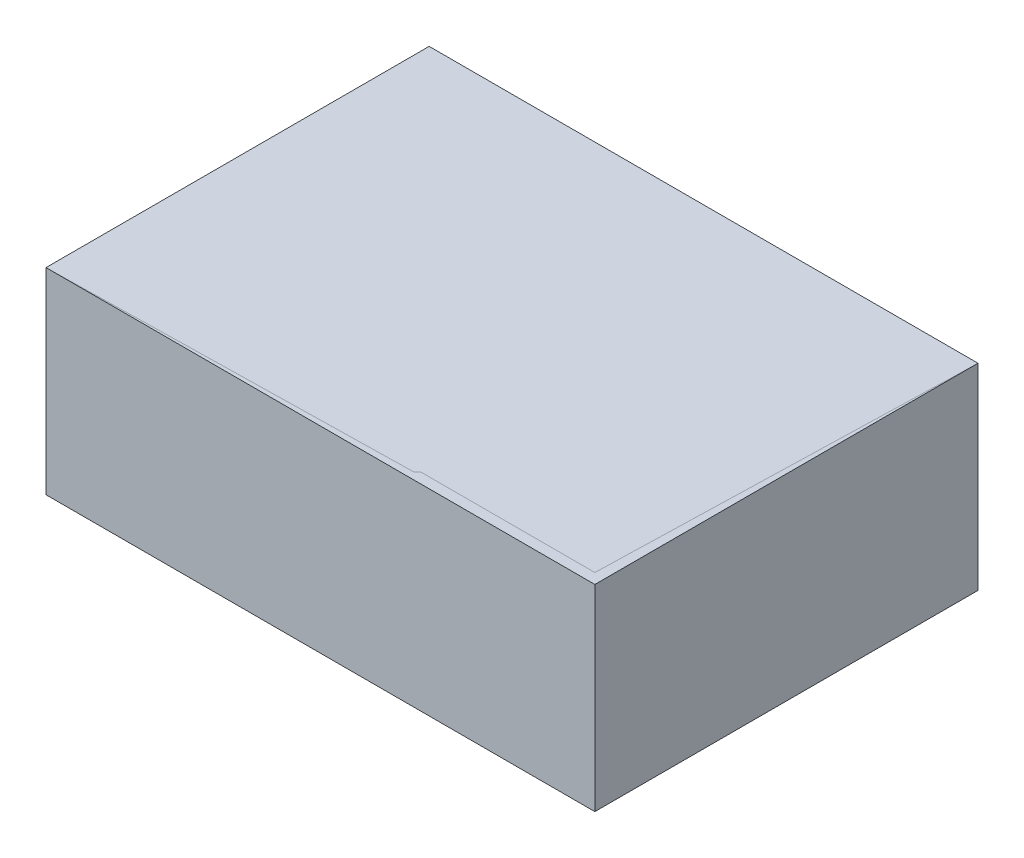
ISO-10303-21;
HEADER;
FILE_DESCRIPTION(('STEP AP214'),'2;1');
FILE_NAME('part.step','',(''),(''),'','','');
FILE_SCHEMA(('AUTOMOTIVE_DESIGN { 1 0 10303 214 1 1 1 1 }'));
ENDSEC;
DATA;
#1=APPLICATION_CONTEXT('core data for automotive mechanical design processes');
#2=APPLICATION_PROTOCOL_DEFINITION('international standard','automotive_design',2000,#1);
#3=PRODUCT_CONTEXT('',#1,'mechanical');
#4=PRODUCT('Part','Part','',(#3));
#5=PRODUCT_RELATED_PRODUCT_CATEGORY('part','',(#4));
#6=PRODUCT_DEFINITION_FORMATION('','',#4);
#7=PRODUCT_DEFINITION_CONTEXT('part definition',#1,'design');
#8=PRODUCT_DEFINITION('design','',#6,#7);
#9=PRODUCT_DEFINITION_SHAPE('','',#8);
#10=(LENGTH_UNIT() NAMED_UNIT(*) SI_UNIT(.MILLI.,.METRE.));
#11=(NAMED_UNIT(*) PLANE_ANGLE_UNIT() SI_UNIT($,.RADIAN.));
#12=(NAMED_UNIT(*) SI_UNIT($,.STERADIAN.) SOLID_ANGLE_UNIT());
#13=UNCERTAINTY_MEASURE_WITH_UNIT(LENGTH_MEASURE(1.E-05),#10,'distance_accuracy_value','');
#14=(GEOMETRIC_REPRESENTATION_CONTEXT(3) GLOBAL_UNCERTAINTY_ASSIGNED_CONTEXT((#13)) GLOBAL_UNIT_ASSIGNED_CONTEXT((#10,
#11,#12)) REPRESENTATION_CONTEXT('',''));
#15=CARTESIAN_POINT('',(0.,0.,0.));
#16=DIRECTION('',(0.,0.,1.));
#17=DIRECTION('',(1.,0.,0.));
#18=AXIS2_PLACEMENT_3D('',#15,#16,#17);
#19=CARTESIAN_POINT('',(0.,95.,0.));
#20=DIRECTION('',(0.,1.,0.));
#21=DIRECTION('',(0.,0.,1.));
#22=AXIS2_PLACEMENT_3D('',#19,#20,#21);
#23=PLANE('',#22);
#24=DIRECTION('',(1.,0.,0.));
#25=VECTOR('',#24,1.);
#26=CARTESIAN_POINT('',(-132.5,95.,92.5));
#27=LINE('',#26,#25);
#28=CARTESIAN_POINT('',(-132.5,95.,92.5));
#29=VERTEX_POINT('',#28);
#30=CARTESIAN_POINT('',(132.5,95.,92.5));
#31=VERTEX_POINT('',#30);
#32=EDGE_CURVE('E56',#29,#31,#27,.T.);
#33=ORIENTED_EDGE('',*,*,#32,.T.);
#34=DIRECTION('',(0.,0.,-1.));
#35=VECTOR('',#34,1.);
#36=CARTESIAN_POINT('',(132.5,95.,92.5));
#37=LINE('',#36,#35);
#38=CARTESIAN_POINT('',(132.5,95.,-92.5));
#39=VERTEX_POINT('',#38);
#40=EDGE_CURVE('E67',#31,#39,#37,.T.);
#41=ORIENTED_EDGE('',*,*,#40,.T.);
#42=DIRECTION('',(-1.,0.,0.));
#43=VECTOR('',#42,1.);
#44=CARTESIAN_POINT('',(132.5,95.,-92.5));
#45=LINE('',#44,#43);
#46=CARTESIAN_POINT('',(-132.5,95.,-92.5));
#47=VERTEX_POINT('',#46);
#48=EDGE_CURVE('E52',#39,#47,#45,.T.);
#49=ORIENTED_EDGE('',*,*,#48,.T.);
#50=DIRECTION('',(0.,0.,1.));
#51=VECTOR('',#50,1.);
#52=CARTESIAN_POINT('',(-132.5,95.,-92.5));
#53=LINE('',#52,#51);
#54=EDGE_CURVE('E12',#47,#29,#53,.T.);
#55=ORIENTED_EDGE('',*,*,#54,.T.);
#56=EDGE_LOOP('',(#33,#41,#49,#55));
#57=FACE_BOUND('',#56,.T.);
#58=ADVANCED_FACE('F47',(#57),#23,.T.);
#59=OPEN_SHELL('',(#58));
#60=SHELL_BASED_SURFACE_MODEL('B2',(#59));
#61=CARTESIAN_POINT('',(132.5,95.,92.5));
#62=DIRECTION('',(-1.,0.,0.));
#63=DIRECTION('',(0.,0.,1.));
#64=AXIS2_PLACEMENT_3D('',#61,#62,#63);
#65=PLANE('',#64);
#66=DIRECTION('',(0.,0.,-1.));
#67=VECTOR('',#66,1.);
#68=CARTESIAN_POINT('',(132.5,0.,92.5));
#69=LINE('',#68,#67);
#70=CARTESIAN_POINT('',(132.5,0.,92.5));
#71=VERTEX_POINT('',#70);
#72=CARTESIAN_POINT('',(132.5,0.,-92.5));
#73=VERTEX_POINT('',#72);
#74=EDGE_CURVE('E199',#71,#73,#69,.T.);
#75=ORIENTED_EDGE('',*,*,#74,.T.);
#76=DIRECTION('',(0.,-1.,0.));
#77=VECTOR('',#76,1.);
#78=CARTESIAN_POINT('',(132.5,95.,-92.5));
#79=LINE('',#78,#77);
#80=CARTESIAN_POINT('',(132.5,95.,-92.5));
#81=VERTEX_POINT('',#80);
#82=EDGE_CURVE('E45',#81,#73,#79,.T.);
#83=ORIENTED_EDGE('',*,*,#82,.F.);
#84=DIRECTION('',(0.,0.,-1.));
#85=VECTOR('',#84,1.);
#86=CARTESIAN_POINT('',(132.5,95.,92.5));
#87=LINE('',#86,#85);
#88=CARTESIAN_POINT('',(132.5,95.,92.5));
#89=VERTEX_POINT('',#88);
#90=EDGE_CURVE('E203',#89,#81,#87,.T.);
#91=ORIENTED_EDGE('',*,*,#90,.F.);
#92=DIRECTION('',(0.,-1.,0.));
#93=VECTOR('',#92,1.);
#94=CARTESIAN_POINT('',(132.5,95.,92.5));
#95=LINE('',#94,#93);
#96=EDGE_CURVE('E209',#89,#71,#95,.T.);
#97=ORIENTED_EDGE('',*,*,#96,.T.);
#98=EDGE_LOOP('',(#75,#83,#91,#97));
#99=FACE_BOUND('',#98,.T.);
#100=ADVANCED_FACE('F91',(#99),#65,.F.);
#101=CARTESIAN_POINT('',(-132.5,95.,-92.5));
#102=DIRECTION('',(0.,0.,1.));
#103=DIRECTION('',(1.,0.,0.));
#104=AXIS2_PLACEMENT_3D('',#101,#102,#103);
#105=PLANE('',#104);
#106=DIRECTION('',(-1.,0.,0.));
#107=VECTOR('',#106,1.);
#108=CARTESIAN_POINT('',(-132.5,0.,-92.5));
#109=LINE('',#108,#107);
#110=CARTESIAN_POINT('',(-132.5,0.,-92.5));
#111=VERTEX_POINT('',#110);
#112=EDGE_CURVE('E212',#73,#111,#109,.T.);
#113=ORIENTED_EDGE('',*,*,#112,.T.);
#114=DIRECTION('',(0.,-1.,0.));
#115=VECTOR('',#114,1.);
#116=CARTESIAN_POINT('',(-132.5,95.,-92.5));
#117=LINE('',#116,#115);
#118=CARTESIAN_POINT('',(-132.5,95.,-92.5));
#119=VERTEX_POINT('',#118);
#120=EDGE_CURVE('E98',#119,#111,#117,.T.);
#121=ORIENTED_EDGE('',*,*,#120,.F.);
#122=DIRECTION('',(-1.,0.,0.));
#123=VECTOR('',#122,1.);
#124=CARTESIAN_POINT('',(-132.5,95.,-92.5));
#125=LINE('',#124,#123);
#126=EDGE_CURVE('E142',#81,#119,#125,.T.);
#127=ORIENTED_EDGE('',*,*,#126,.F.);
#128=ORIENTED_EDGE('',*,*,#82,.T.);
#129=EDGE_LOOP('',(#113,#121,#127,#128));
#130=FACE_BOUND('',#129,.T.);
#131=ADVANCED_FACE('F241',(#130),#105,.F.);
#132=CARTESIAN_POINT('',(-132.5,95.,92.5));
#133=DIRECTION('',(1.,0.,0.));
#134=DIRECTION('',(0.,0.,-1.));
#135=AXIS2_PLACEMENT_3D('',#132,#133,#134);
#136=PLANE('',#135);
#137=DIRECTION('',(0.,0.,1.));
#138=VECTOR('',#137,1.);
#139=CARTESIAN_POINT('',(-132.5,0.,92.5));
#140=LINE('',#139,#138);
#141=CARTESIAN_POINT('',(-132.5,0.,92.5));
#142=VERTEX_POINT('',#141);
#143=EDGE_CURVE('E214',#111,#142,#140,.T.);
#144=ORIENTED_EDGE('',*,*,#143,.T.);
#145=DIRECTION('',(0.,-1.,0.));
#146=VECTOR('',#145,1.);
#147=CARTESIAN_POINT('',(-132.5,95.,92.5));
#148=LINE('',#147,#146);
#149=CARTESIAN_POINT('',(-132.5,95.,92.5));
#150=VERTEX_POINT('',#149);
#151=EDGE_CURVE('E218',#150,#142,#148,.T.);
#152=ORIENTED_EDGE('',*,*,#151,.F.);
#153=DIRECTION('',(0.,0.,1.));
#154=VECTOR('',#153,1.);
#155=CARTESIAN_POINT('',(-132.5,95.,92.5));
#156=LINE('',#155,#154);
#157=EDGE_CURVE('E206',#119,#150,#156,.T.);
#158=ORIENTED_EDGE('',*,*,#157,.F.);
#159=ORIENTED_EDGE('',*,*,#120,.T.);
#160=EDGE_LOOP('',(#144,#152,#158,#159));
#161=FACE_BOUND('',#160,.T.);
#162=ADVANCED_FACE('F223',(#161),#136,.F.);
#163=CARTESIAN_POINT('',(-132.5,95.,92.5));
#164=DIRECTION('',(0.,0.,-1.));
#165=DIRECTION('',(-1.,0.,0.));
#166=AXIS2_PLACEMENT_3D('',#163,#164,#165);
#167=PLANE('',#166);
#168=DIRECTION('',(1.,0.,0.));
#169=VECTOR('',#168,1.);
#170=CARTESIAN_POINT('',(-132.5,0.,92.5));
#171=LINE('',#170,#169);
#172=EDGE_CURVE('E135',#142,#71,#171,.T.);
#173=ORIENTED_EDGE('',*,*,#172,.T.);
#174=ORIENTED_EDGE('',*,*,#96,.F.);
#175=DIRECTION('',(1.,0.,0.));
#176=VECTOR('',#175,1.);
#177=CARTESIAN_POINT('',(-132.5,95.,92.5));
#178=LINE('',#177,#176);
#179=EDGE_CURVE('E114',#150,#89,#178,.T.);
#180=ORIENTED_EDGE('',*,*,#179,.F.);
#181=ORIENTED_EDGE('',*,*,#151,.T.);
#182=EDGE_LOOP('',(#173,#174,#180,#181));
#183=FACE_BOUND('',#182,.T.);
#184=ADVANCED_FACE('F231',(#183),#167,.F.);
#185=CARTESIAN_POINT('',(0.,95.,0.));
#186=DIRECTION('',(0.,-1.,0.));
#187=DIRECTION('',(0.,0.,-1.));
#188=AXIS2_PLACEMENT_3D('',#185,#186,#187);
#189=PLANE('',#188);
#190=DIRECTION('',(-1.,0.,0.));
#191=VECTOR('',#190,1.);
#192=CARTESIAN_POINT('',(-127.5,95.,-87.5));
#193=LINE('',#192,#191);
#194=CARTESIAN_POINT('',(127.5,95.,-87.5));
#195=VERTEX_POINT('',#194);
#196=CARTESIAN_POINT('',(-127.5,95.,-87.5));
#197=VERTEX_POINT('',#196);
#198=EDGE_CURVE('E193',#195,#197,#193,.T.);
#199=ORIENTED_EDGE('',*,*,#198,.F.);
#200=DIRECTION('',(0.,0.,-1.));
#201=VECTOR('',#200,1.);
#202=CARTESIAN_POINT('',(127.5,95.,87.5));
#203=LINE('',#202,#201);
#204=CARTESIAN_POINT('',(127.5,95.,87.5));
#205=VERTEX_POINT('',#204);
#206=EDGE_CURVE('E105',#205,#195,#203,.T.);
#207=ORIENTED_EDGE('',*,*,#206,.F.);
#208=DIRECTION('',(1.,0.,0.));
#209=VECTOR('',#208,1.);
#210=CARTESIAN_POINT('',(-127.5,95.,87.5));
#211=LINE('',#210,#209);
#212=CARTESIAN_POINT('',(-127.5,95.,87.5));
#213=VERTEX_POINT('',#212);
#214=EDGE_CURVE('E184',#213,#205,#211,.T.);
#215=ORIENTED_EDGE('',*,*,#214,.F.);
#216=DIRECTION('',(0.,0.,1.));
#217=VECTOR('',#216,1.);
#218=CARTESIAN_POINT('',(-127.5,95.,87.5));
#219=LINE('',#218,#217);
#220=EDGE_CURVE('E187',#197,#213,#219,.T.);
#221=ORIENTED_EDGE('',*,*,#220,.F.);
#222=EDGE_LOOP('',(#199,#207,#215,#221));
#223=FACE_BOUND('',#222,.T.);
#224=ORIENTED_EDGE('',*,*,#90,.T.);
#225=ORIENTED_EDGE('',*,*,#126,.T.);
#226=ORIENTED_EDGE('',*,*,#157,.T.);
#227=ORIENTED_EDGE('',*,*,#179,.T.);
#228=EDGE_LOOP('',(#224,#225,#226,#227));
#229=FACE_BOUND('',#228,.T.);
#230=ADVANCED_FACE('F233',(#223,#229),#189,.F.);
#231=CARTESIAN_POINT('',(0.,0.,0.));
#232=DIRECTION('',(0.,-1.,0.));
#233=DIRECTION('',(0.,0.,-1.));
#234=AXIS2_PLACEMENT_3D('',#231,#232,#233);
#235=PLANE('',#234);
#236=ORIENTED_EDGE('',*,*,#74,.F.);
#237=ORIENTED_EDGE('',*,*,#172,.F.);
#238=ORIENTED_EDGE('',*,*,#143,.F.);
#239=ORIENTED_EDGE('',*,*,#112,.F.);
#240=EDGE_LOOP('',(#236,#237,#238,#239));
#241=FACE_BOUND('',#240,.T.);
#242=ADVANCED_FACE('F227',(#241),#235,.T.);
#243=CARTESIAN_POINT('',(127.5,9.99999999999999,87.5));
#244=DIRECTION('',(1.,0.,0.));
#245=DIRECTION('',(0.,0.,-1.));
#246=AXIS2_PLACEMENT_3D('',#243,#244,#245);
#247=PLANE('',#246);
#248=ORIENTED_EDGE('',*,*,#206,.T.);
#249=DIRECTION('',(0.,1.,0.));
#250=VECTOR('',#249,1.);
#251=CARTESIAN_POINT('',(127.5,9.99999999999999,-87.5));
#252=LINE('',#251,#250);
#253=CARTESIAN_POINT('',(127.5,9.99999999999999,-87.5));
#254=VERTEX_POINT('',#253);
#255=EDGE_CURVE('E162',#254,#195,#252,.T.);
#256=ORIENTED_EDGE('',*,*,#255,.F.);
#257=DIRECTION('',(0.,0.,-1.));
#258=VECTOR('',#257,1.);
#259=CARTESIAN_POINT('',(127.5,9.99999999999999,87.5));
#260=LINE('',#259,#258);
#261=CARTESIAN_POINT('',(127.5,9.99999999999999,87.5));
#262=VERTEX_POINT('',#261);
#263=EDGE_CURVE('E166',#262,#254,#260,.T.);
#264=ORIENTED_EDGE('',*,*,#263,.F.);
#265=DIRECTION('',(0.,1.,0.));
#266=VECTOR('',#265,1.);
#267=CARTESIAN_POINT('',(127.5,9.99999999999999,87.5));
#268=LINE('',#267,#266);
#269=EDGE_CURVE('E197',#262,#205,#268,.T.);
#270=ORIENTED_EDGE('',*,*,#269,.T.);
#271=EDGE_LOOP('',(#248,#256,#264,#270));
#272=FACE_BOUND('',#271,.T.);
#273=ADVANCED_FACE('F164',(#272),#247,.F.);
#274=CARTESIAN_POINT('',(-127.5,9.99999999999999,87.5));
#275=DIRECTION('',(0.,0.,1.));
#276=DIRECTION('',(1.,0.,0.));
#277=AXIS2_PLACEMENT_3D('',#274,#275,#276);
#278=PLANE('',#277);
#279=ORIENTED_EDGE('',*,*,#214,.T.);
#280=ORIENTED_EDGE('',*,*,#269,.F.);
#281=DIRECTION('',(1.,0.,0.));
#282=VECTOR('',#281,1.);
#283=CARTESIAN_POINT('',(-127.5,9.99999999999999,87.5));
#284=LINE('',#283,#282);
#285=CARTESIAN_POINT('',(-127.5,9.99999999999999,87.5));
#286=VERTEX_POINT('',#285);
#287=EDGE_CURVE('E172',#286,#262,#284,.T.);
#288=ORIENTED_EDGE('',*,*,#287,.F.);
#289=DIRECTION('',(0.,1.,0.));
#290=VECTOR('',#289,1.);
#291=CARTESIAN_POINT('',(-127.5,9.99999999999999,87.5));
#292=LINE('',#291,#290);
#293=EDGE_CURVE('E200',#286,#213,#292,.T.);
#294=ORIENTED_EDGE('',*,*,#293,.T.);
#295=EDGE_LOOP('',(#279,#280,#288,#294));
#296=FACE_BOUND('',#295,.T.);
#297=ADVANCED_FACE('F280',(#296),#278,.F.);
#298=CARTESIAN_POINT('',(-127.5,9.99999999999999,87.5));
#299=DIRECTION('',(-1.,0.,0.));
#300=DIRECTION('',(0.,0.,1.));
#301=AXIS2_PLACEMENT_3D('',#298,#299,#300);
#302=PLANE('',#301);
#303=ORIENTED_EDGE('',*,*,#220,.T.);
#304=ORIENTED_EDGE('',*,*,#293,.F.);
#305=DIRECTION('',(0.,0.,1.));
#306=VECTOR('',#305,1.);
#307=CARTESIAN_POINT('',(-127.5,9.99999999999999,87.5));
#308=LINE('',#307,#306);
#309=CARTESIAN_POINT('',(-127.5,9.99999999999999,-87.5));
#310=VERTEX_POINT('',#309);
#311=EDGE_CURVE('E180',#310,#286,#308,.T.);
#312=ORIENTED_EDGE('',*,*,#311,.F.);
#313=DIRECTION('',(0.,1.,0.));
#314=VECTOR('',#313,1.);
#315=CARTESIAN_POINT('',(-127.5,9.99999999999999,-87.5));
#316=LINE('',#315,#314);
#317=EDGE_CURVE('E171',#310,#197,#316,.T.);
#318=ORIENTED_EDGE('',*,*,#317,.T.);
#319=EDGE_LOOP('',(#303,#304,#312,#318));
#320=FACE_BOUND('',#319,.T.);
#321=ADVANCED_FACE('F289',(#320),#302,.F.);
#322=CARTESIAN_POINT('',(-127.5,9.99999999999999,-87.5));
#323=DIRECTION('',(0.,0.,-1.));
#324=DIRECTION('',(-1.,0.,0.));
#325=AXIS2_PLACEMENT_3D('',#322,#323,#324);
#326=PLANE('',#325);
#327=ORIENTED_EDGE('',*,*,#198,.T.);
#328=ORIENTED_EDGE('',*,*,#317,.F.);
#329=DIRECTION('',(-1.,0.,0.));
#330=VECTOR('',#329,1.);
#331=CARTESIAN_POINT('',(-127.5,9.99999999999999,-87.5));
#332=LINE('',#331,#330);
#333=EDGE_CURVE('E175',#254,#310,#332,.T.);
#334=ORIENTED_EDGE('',*,*,#333,.F.);
#335=ORIENTED_EDGE('',*,*,#255,.T.);
#336=EDGE_LOOP('',(#327,#328,#334,#335));
#337=FACE_BOUND('',#336,.T.);
#338=ADVANCED_FACE('F176',(#337),#326,.F.);
#339=CARTESIAN_POINT('',(0.,9.99999999999999,0.));
#340=DIRECTION('',(0.,-1.,0.));
#341=DIRECTION('',(0.,0.,-1.));
#342=AXIS2_PLACEMENT_3D('',#339,#340,#341);
#343=PLANE('',#342);
#344=ORIENTED_EDGE('',*,*,#263,.T.);
#345=ORIENTED_EDGE('',*,*,#333,.T.);
#346=ORIENTED_EDGE('',*,*,#311,.T.);
#347=ORIENTED_EDGE('',*,*,#287,.T.);
#348=EDGE_LOOP('',(#344,#345,#346,#347));
#349=FACE_BOUND('',#348,.T.);
#350=ADVANCED_FACE('F182',(#349),#343,.F.);
#351=CLOSED_SHELL('',(#100,#131,#162,#184,#230,#242,#273,#297,#321,#338,#350));
#352=MANIFOLD_SOLID_BREP('B6',#351);
#353=ADVANCED_BREP_SHAPE_REPRESENTATION('',(#18,#352),#14);
#354=MANIFOLD_SURFACE_SHAPE_REPRESENTATION('',(#18,#60),#14);
#355=SHAPE_REPRESENTATION('',(#18),#14);
#356=SHAPE_DEFINITION_REPRESENTATION(#9,#355);
#357=SHAPE_REPRESENTATION_RELATIONSHIP('','',#355,#353);
#358=SHAPE_REPRESENTATION_RELATIONSHIP('','',#355,#354);
ENDSEC;
END-ISO-10303-21;
